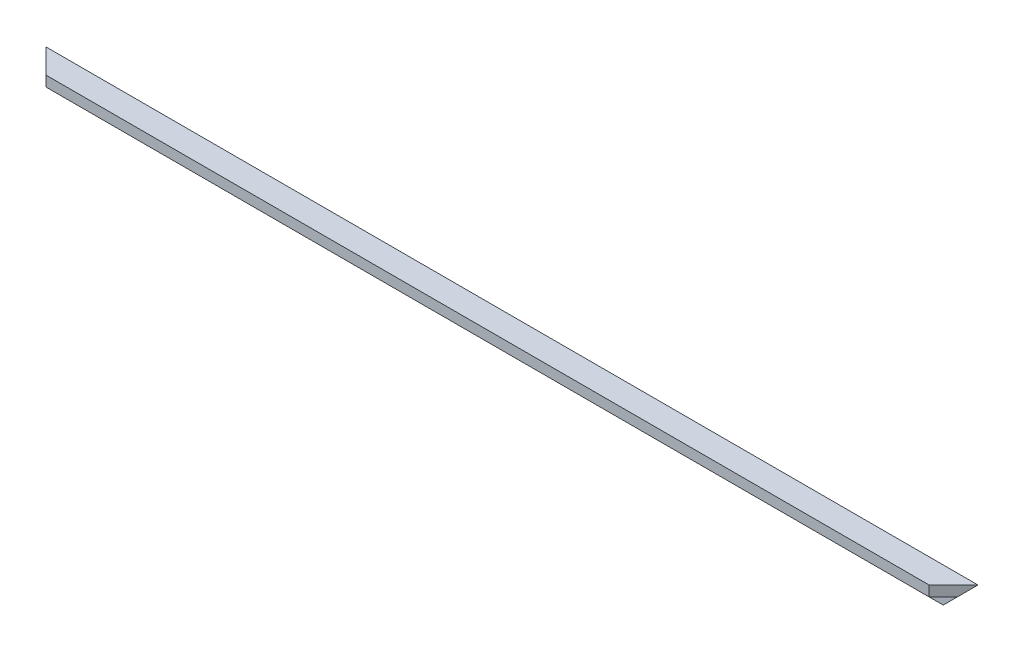
ISO-10303-21;
HEADER;
FILE_DESCRIPTION(('STEP AP214'),'2;1');
FILE_NAME('part.step','',(''),(''),'','','');
FILE_SCHEMA(('AUTOMOTIVE_DESIGN { 1 0 10303 214 1 1 1 1 }'));
ENDSEC;
DATA;
#1=APPLICATION_CONTEXT('core data for automotive mechanical design processes');
#2=APPLICATION_PROTOCOL_DEFINITION('international standard','automotive_design',2000,#1);
#3=PRODUCT_CONTEXT('',#1,'mechanical');
#4=PRODUCT('Part','Part','',(#3));
#5=PRODUCT_RELATED_PRODUCT_CATEGORY('part','',(#4));
#6=PRODUCT_DEFINITION_FORMATION('','',#4);
#7=PRODUCT_DEFINITION_CONTEXT('part definition',#1,'design');
#8=PRODUCT_DEFINITION('design','',#6,#7);
#9=PRODUCT_DEFINITION_SHAPE('','',#8);
#10=(LENGTH_UNIT() NAMED_UNIT(*) SI_UNIT(.MILLI.,.METRE.));
#11=(NAMED_UNIT(*) PLANE_ANGLE_UNIT() SI_UNIT($,.RADIAN.));
#12=(NAMED_UNIT(*) SI_UNIT($,.STERADIAN.) SOLID_ANGLE_UNIT());
#13=UNCERTAINTY_MEASURE_WITH_UNIT(LENGTH_MEASURE(1.E-05),#10,'distance_accuracy_value','');
#14=(GEOMETRIC_REPRESENTATION_CONTEXT(3) GLOBAL_UNCERTAINTY_ASSIGNED_CONTEXT((#13)) GLOBAL_UNIT_ASSIGNED_CONTEXT((#10,
#11,#12)) REPRESENTATION_CONTEXT('',''));
#15=CARTESIAN_POINT('',(0.,0.,0.));
#16=DIRECTION('',(0.,0.,1.));
#17=DIRECTION('',(1.,0.,0.));
#18=AXIS2_PLACEMENT_3D('',#15,#16,#17);
#19=CARTESIAN_POINT('',(1527.,-40.,0.));
#20=DIRECTION('',(0.,0.,1.));
#21=DIRECTION('',(1.,0.,0.));
#22=AXIS2_PLACEMENT_3D('',#19,#20,#21);
#23=PLANE('',#22);
#24=DIRECTION('',(-1.,0.,0.));
#25=VECTOR('',#24,1.);
#26=CARTESIAN_POINT('',(1527.,0.,0.));
#27=LINE('',#26,#25);
#28=CARTESIAN_POINT('',(1527.,0.,0.));
#29=VERTEX_POINT('',#28);
#30=CARTESIAN_POINT('',(0.,0.,0.));
#31=VERTEX_POINT('',#30);
#32=EDGE_CURVE('E102',#29,#31,#27,.T.);
#33=ORIENTED_EDGE('',*,*,#32,.F.);
#34=DIRECTION('',(0.70710678118655,0.707106781186545,0.));
#35=VECTOR('',#34,1.);
#36=CARTESIAN_POINT('',(1527.,0.,0.));
#37=LINE('',#36,#35);
#38=CARTESIAN_POINT('',(1487.,-40.,0.));
#39=VERTEX_POINT('',#38);
#40=EDGE_CURVE('E87',#39,#29,#37,.T.);
#41=ORIENTED_EDGE('',*,*,#40,.F.);
#42=DIRECTION('',(-1.,0.,0.));
#43=VECTOR('',#42,1.);
#44=CARTESIAN_POINT('',(1527.,-40.,0.));
#45=LINE('',#44,#43);
#46=CARTESIAN_POINT('',(40.,-40.,0.));
#47=VERTEX_POINT('',#46);
#48=EDGE_CURVE('E100',#39,#47,#45,.T.);
#49=ORIENTED_EDGE('',*,*,#48,.T.);
#50=DIRECTION('',(0.707106781186548,-0.707106781186548,0.));
#51=VECTOR('',#50,1.);
#52=CARTESIAN_POINT('',(0.,0.,0.));
#53=LINE('',#52,#51);
#54=EDGE_CURVE('E151',#31,#47,#53,.T.);
#55=ORIENTED_EDGE('',*,*,#54,.F.);
#56=EDGE_LOOP('',(#33,#41,#49,#55));
#57=FACE_BOUND('',#56,.T.);
#58=ADVANCED_FACE('F33',(#57),#23,.F.);
#59=CARTESIAN_POINT('',(1527.,0.,0.));
#60=DIRECTION('',(0.,-1.,0.));
#61=DIRECTION('',(0.,0.,-1.));
#62=AXIS2_PLACEMENT_3D('',#59,#60,#61);
#63=PLANE('',#62);
#64=DIRECTION('',(-1.,0.,0.));
#65=VECTOR('',#64,1.);
#66=CARTESIAN_POINT('',(1527.,0.,40.));
#67=LINE('',#66,#65);
#68=CARTESIAN_POINT('',(1487.,0.,40.));
#69=VERTEX_POINT('',#68);
#70=CARTESIAN_POINT('',(40.,0.,40.));
#71=VERTEX_POINT('',#70);
#72=EDGE_CURVE('E121',#69,#71,#67,.T.);
#73=ORIENTED_EDGE('',*,*,#72,.F.);
#74=DIRECTION('',(-0.70710678118655,0.,0.707106781186545));
#75=VECTOR('',#74,1.);
#76=CARTESIAN_POINT('',(1527.,0.,0.));
#77=LINE('',#76,#75);
#78=EDGE_CURVE('E126',#29,#69,#77,.T.);
#79=ORIENTED_EDGE('',*,*,#78,.F.);
#80=ORIENTED_EDGE('',*,*,#32,.T.);
#81=DIRECTION('',(-0.707106781186548,0.,-0.707106781186547));
#82=VECTOR('',#81,1.);
#83=CARTESIAN_POINT('',(40.,0.,40.));
#84=LINE('',#83,#82);
#85=EDGE_CURVE('E135',#71,#31,#84,.T.);
#86=ORIENTED_EDGE('',*,*,#85,.F.);
#87=EDGE_LOOP('',(#73,#79,#80,#86));
#88=FACE_BOUND('',#87,.T.);
#89=ADVANCED_FACE('F130',(#88),#63,.F.);
#90=CARTESIAN_POINT('',(1527.,0.,40.));
#91=DIRECTION('',(0.,0.,-1.));
#92=DIRECTION('',(-1.,0.,0.));
#93=AXIS2_PLACEMENT_3D('',#90,#91,#92);
#94=PLANE('',#93);
#95=DIRECTION('',(-1.,0.,0.));
#96=VECTOR('',#95,1.);
#97=CARTESIAN_POINT('',(1527.,-17.,40.));
#98=LINE('',#97,#96);
#99=CARTESIAN_POINT('',(1487.,-17.,40.));
#100=VERTEX_POINT('',#99);
#101=CARTESIAN_POINT('',(40.,-17.,40.));
#102=VERTEX_POINT('',#101);
#103=EDGE_CURVE('E118',#100,#102,#98,.T.);
#104=ORIENTED_EDGE('',*,*,#103,.F.);
#105=DIRECTION('',(0.,1.,0.));
#106=VECTOR('',#105,1.);
#107=CARTESIAN_POINT('',(1487.,-40.,40.));
#108=LINE('',#107,#106);
#109=EDGE_CURVE('E47',#100,#69,#108,.T.);
#110=ORIENTED_EDGE('',*,*,#109,.T.);
#111=ORIENTED_EDGE('',*,*,#72,.T.);
#112=DIRECTION('',(0.,1.,0.));
#113=VECTOR('',#112,1.);
#114=CARTESIAN_POINT('',(40.,-40.,40.));
#115=LINE('',#114,#113);
#116=EDGE_CURVE('E132',#102,#71,#115,.T.);
#117=ORIENTED_EDGE('',*,*,#116,.F.);
#118=EDGE_LOOP('',(#104,#110,#111,#117));
#119=FACE_BOUND('',#118,.T.);
#120=ADVANCED_FACE('F155',(#119),#94,.F.);
#121=CARTESIAN_POINT('',(1527.,-17.,40.));
#122=DIRECTION('',(0.,1.,0.));
#123=DIRECTION('',(0.,0.,1.));
#124=AXIS2_PLACEMENT_3D('',#121,#122,#123);
#125=PLANE('',#124);
#126=DIRECTION('',(-1.,0.,0.));
#127=VECTOR('',#126,1.);
#128=CARTESIAN_POINT('',(1527.,-17.,17.));
#129=LINE('',#128,#127);
#130=CARTESIAN_POINT('',(1510.,-17.,17.));
#131=VERTEX_POINT('',#130);
#132=CARTESIAN_POINT('',(17.0000000000001,-17.,17.));
#133=VERTEX_POINT('',#132);
#134=EDGE_CURVE('E110',#131,#133,#129,.T.);
#135=ORIENTED_EDGE('',*,*,#134,.F.);
#136=DIRECTION('',(-0.70710678118655,0.,0.707106781186545));
#137=VECTOR('',#136,1.);
#138=CARTESIAN_POINT('',(1507.,-17.,19.9999999999999));
#139=LINE('',#138,#137);
#140=EDGE_CURVE('E108',#131,#100,#139,.T.);
#141=ORIENTED_EDGE('',*,*,#140,.T.);
#142=ORIENTED_EDGE('',*,*,#103,.T.);
#143=DIRECTION('',(-0.707106781186548,0.,-0.707106781186548));
#144=VECTOR('',#143,1.);
#145=CARTESIAN_POINT('',(783.5,-17.,783.5));
#146=LINE('',#145,#144);
#147=EDGE_CURVE('E112',#102,#133,#146,.T.);
#148=ORIENTED_EDGE('',*,*,#147,.T.);
#149=EDGE_LOOP('',(#135,#141,#142,#148));
#150=FACE_BOUND('',#149,.T.);
#151=ADVANCED_FACE('F143',(#150),#125,.F.);
#152=CARTESIAN_POINT('',(1527.,-17.,17.));
#153=DIRECTION('',(0.,0.,-1.));
#154=DIRECTION('',(0.,1.,0.));
#155=AXIS2_PLACEMENT_3D('',#152,#153,#154);
#156=PLANE('',#155);
#157=DIRECTION('',(-1.,0.,0.));
#158=VECTOR('',#157,1.);
#159=CARTESIAN_POINT('',(1527.,-40.,17.));
#160=LINE('',#159,#158);
#161=CARTESIAN_POINT('',(1487.,-40.,17.));
#162=VERTEX_POINT('',#161);
#163=CARTESIAN_POINT('',(40.,-40.,17.));
#164=VERTEX_POINT('',#163);
#165=EDGE_CURVE('E107',#162,#164,#160,.T.);
#166=ORIENTED_EDGE('',*,*,#165,.F.);
#167=DIRECTION('',(0.70710678118655,0.707106781186545,0.));
#168=VECTOR('',#167,1.);
#169=CARTESIAN_POINT('',(1518.5,-8.49999999999995,17.));
#170=LINE('',#169,#168);
#171=EDGE_CURVE('E90',#162,#131,#170,.T.);
#172=ORIENTED_EDGE('',*,*,#171,.T.);
#173=ORIENTED_EDGE('',*,*,#134,.T.);
#174=DIRECTION('',(0.707106781186548,-0.707106781186548,0.));
#175=VECTOR('',#174,1.);
#176=CARTESIAN_POINT('',(772.,-772.,16.9999999999999));
#177=LINE('',#176,#175);
#178=EDGE_CURVE('E55',#133,#164,#177,.T.);
#179=ORIENTED_EDGE('',*,*,#178,.T.);
#180=EDGE_LOOP('',(#166,#172,#173,#179));
#181=FACE_BOUND('',#180,.T.);
#182=ADVANCED_FACE('F148',(#181),#156,.F.);
#183=CARTESIAN_POINT('',(1527.,-40.,17.));
#184=DIRECTION('',(0.,1.,0.));
#185=DIRECTION('',(0.,0.,1.));
#186=AXIS2_PLACEMENT_3D('',#183,#184,#185);
#187=PLANE('',#186);
#188=ORIENTED_EDGE('',*,*,#48,.F.);
#189=DIRECTION('',(0.,0.,-1.));
#190=VECTOR('',#189,1.);
#191=CARTESIAN_POINT('',(1487.,-40.,40.));
#192=LINE('',#191,#190);
#193=EDGE_CURVE('E84',#162,#39,#192,.T.);
#194=ORIENTED_EDGE('',*,*,#193,.F.);
#195=ORIENTED_EDGE('',*,*,#165,.T.);
#196=DIRECTION('',(0.,0.,-1.));
#197=VECTOR('',#196,1.);
#198=CARTESIAN_POINT('',(40.,-40.,40.));
#199=LINE('',#198,#197);
#200=EDGE_CURVE('E103',#164,#47,#199,.T.);
#201=ORIENTED_EDGE('',*,*,#200,.T.);
#202=EDGE_LOOP('',(#188,#194,#195,#201));
#203=FACE_BOUND('',#202,.T.);
#204=ADVANCED_FACE('F106',(#203),#187,.F.);
#205=CARTESIAN_POINT('',(40.,-40.,40.));
#206=DIRECTION('',(0.707106781186548,0.,-0.707106781186548));
#207=DIRECTION('',(-0.707106781186548,0.,-0.707106781186548));
#208=AXIS2_PLACEMENT_3D('',#205,#206,#207);
#209=PLANE('',#208);
#210=ORIENTED_EDGE('',*,*,#85,.T.);
#211=DIRECTION('',(0.577350269189626,-0.577350269189626,0.577350269189626));
#212=VECTOR('',#211,1.);
#213=CARTESIAN_POINT('',(40.,-40.,40.));
#214=LINE('',#213,#212);
#215=EDGE_CURVE('E11',#31,#133,#214,.T.);
#216=ORIENTED_EDGE('',*,*,#215,.T.);
#217=ORIENTED_EDGE('',*,*,#147,.F.);
#218=ORIENTED_EDGE('',*,*,#116,.T.);
#219=EDGE_LOOP('',(#210,#216,#217,#218));
#220=FACE_BOUND('',#219,.T.);
#221=ADVANCED_FACE('F153',(#220),#209,.F.);
#222=CARTESIAN_POINT('',(1527.,-40.,0.));
#223=DIRECTION('',(-0.707106781186545,0.,-0.70710678118655));
#224=DIRECTION('',(-0.70710678118655,0.,0.707106781186545));
#225=AXIS2_PLACEMENT_3D('',#222,#223,#224);
#226=PLANE('',#225);
#227=ORIENTED_EDGE('',*,*,#140,.F.);
#228=DIRECTION('',(0.577350269189628,0.577350269189625,-0.577350269189625));
#229=VECTOR('',#228,1.);
#230=CARTESIAN_POINT('',(1513.66666666667,-13.3333333333333,13.3333333333333));
#231=LINE('',#230,#229);
#232=EDGE_CURVE('E40',#131,#29,#231,.T.);
#233=ORIENTED_EDGE('',*,*,#232,.T.);
#234=ORIENTED_EDGE('',*,*,#78,.T.);
#235=ORIENTED_EDGE('',*,*,#109,.F.);
#236=EDGE_LOOP('',(#227,#233,#234,#235));
#237=FACE_BOUND('',#236,.T.);
#238=ADVANCED_FACE('F125',(#237),#226,.F.);
#239=CARTESIAN_POINT('',(1527.,0.,40.));
#240=DIRECTION('',(-0.707106781186545,0.70710678118655,0.));
#241=DIRECTION('',(-0.70710678118655,-0.707106781186545,0.));
#242=AXIS2_PLACEMENT_3D('',#239,#240,#241);
#243=PLANE('',#242);
#244=ORIENTED_EDGE('',*,*,#193,.T.);
#245=ORIENTED_EDGE('',*,*,#40,.T.);
#246=ORIENTED_EDGE('',*,*,#232,.F.);
#247=ORIENTED_EDGE('',*,*,#171,.F.);
#248=EDGE_LOOP('',(#244,#245,#246,#247));
#249=FACE_BOUND('',#248,.T.);
#250=ADVANCED_FACE('F86',(#249),#243,.F.);
#251=CARTESIAN_POINT('',(0.,0.,40.));
#252=DIRECTION('',(0.707106781186548,0.707106781186548,0.));
#253=DIRECTION('',(-0.707106781186548,0.707106781186548,0.));
#254=AXIS2_PLACEMENT_3D('',#251,#252,#253);
#255=PLANE('',#254);
#256=ORIENTED_EDGE('',*,*,#215,.F.);
#257=ORIENTED_EDGE('',*,*,#54,.T.);
#258=ORIENTED_EDGE('',*,*,#200,.F.);
#259=ORIENTED_EDGE('',*,*,#178,.F.);
#260=EDGE_LOOP('',(#256,#257,#258,#259));
#261=FACE_BOUND('',#260,.T.);
#262=ADVANCED_FACE('F152',(#261),#255,.F.);
#263=CLOSED_SHELL('',(#58,#89,#120,#151,#182,#204,#221,#238,#250,#262));
#264=MANIFOLD_SOLID_BREP('B2',#263);
#265=ADVANCED_BREP_SHAPE_REPRESENTATION('',(#18,#264),#14);
#266=SHAPE_DEFINITION_REPRESENTATION(#9,#265);
ENDSEC;
END-ISO-10303-21;
